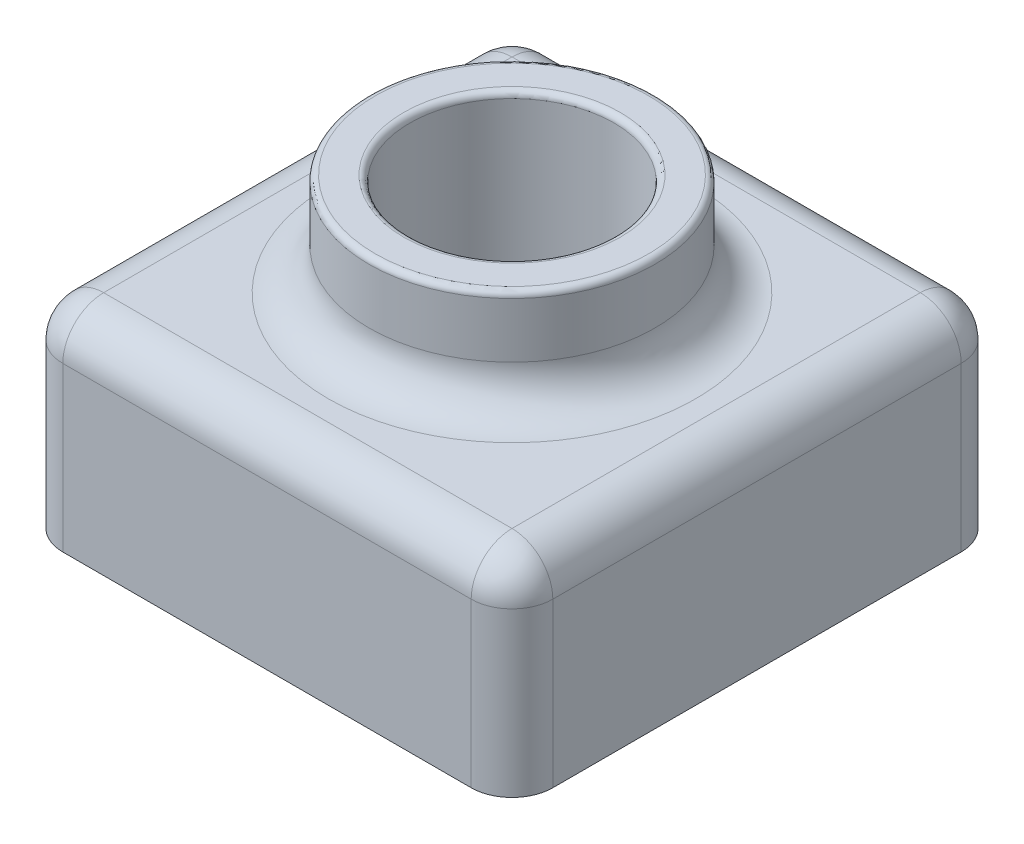
ISO-10303-21;
HEADER;
FILE_DESCRIPTION(('STEP AP214'),'2;1');
FILE_NAME('part.step','',(''),(''),'','','');
FILE_SCHEMA(('AUTOMOTIVE_DESIGN { 1 0 10303 214 1 1 1 1 }'));
ENDSEC;
DATA;
#1=APPLICATION_CONTEXT('core data for automotive mechanical design processes');
#2=APPLICATION_PROTOCOL_DEFINITION('international standard','automotive_design',2000,#1);
#3=PRODUCT_CONTEXT('',#1,'mechanical');
#4=PRODUCT('Part','Part','',(#3));
#5=PRODUCT_RELATED_PRODUCT_CATEGORY('part','',(#4));
#6=PRODUCT_DEFINITION_FORMATION('','',#4);
#7=PRODUCT_DEFINITION_CONTEXT('part definition',#1,'design');
#8=PRODUCT_DEFINITION('design','',#6,#7);
#9=PRODUCT_DEFINITION_SHAPE('','',#8);
#10=(LENGTH_UNIT() NAMED_UNIT(*) SI_UNIT(.MILLI.,.METRE.));
#11=(NAMED_UNIT(*) PLANE_ANGLE_UNIT() SI_UNIT($,.RADIAN.));
#12=(NAMED_UNIT(*) SI_UNIT($,.STERADIAN.) SOLID_ANGLE_UNIT());
#13=UNCERTAINTY_MEASURE_WITH_UNIT(LENGTH_MEASURE(1.E-05),#10,'distance_accuracy_value','');
#14=(GEOMETRIC_REPRESENTATION_CONTEXT(3) GLOBAL_UNCERTAINTY_ASSIGNED_CONTEXT((#13)) GLOBAL_UNIT_ASSIGNED_CONTEXT((#10,
#11,#12)) REPRESENTATION_CONTEXT('',''));
#15=CARTESIAN_POINT('',(0.,0.,0.));
#16=DIRECTION('',(0.,0.,1.));
#17=DIRECTION('',(1.,0.,0.));
#18=AXIS2_PLACEMENT_3D('',#15,#16,#17);
#19=CARTESIAN_POINT('',(0.,0.,0.));
#20=DIRECTION('',(0.,1.,0.));
#21=DIRECTION('',(0.,0.,1.));
#22=AXIS2_PLACEMENT_3D('',#19,#20,#21);
#23=PLANE('',#22);
#24=CARTESIAN_POINT('',(60.,0.,-60.));
#25=DIRECTION('',(0.,1.,0.));
#26=DIRECTION('',(0.,0.,1.));
#27=AXIS2_PLACEMENT_3D('',#24,#25,#26);
#28=CIRCLE('',#27,27.);
#29=CARTESIAN_POINT('',(60.,0.,-33.));
#30=VERTEX_POINT('',#29);
#31=EDGE_CURVE('E261',#30,#30,#28,.T.);
#32=ORIENTED_EDGE('',*,*,#31,.F.);
#33=EDGE_LOOP('',(#32));
#34=FACE_BOUND('',#33,.T.);
#35=CARTESIAN_POINT('',(60.,0.,-60.));
#36=DIRECTION('',(0.,1.,0.));
#37=DIRECTION('',(0.,0.,1.));
#38=AXIS2_PLACEMENT_3D('',#35,#36,#37);
#39=CIRCLE('',#38,25.);
#40=CARTESIAN_POINT('',(60.,0.,-35.));
#41=VERTEX_POINT('',#40);
#42=EDGE_CURVE('E286',#41,#41,#39,.T.);
#43=ORIENTED_EDGE('',*,*,#42,.T.);
#44=EDGE_LOOP('',(#43));
#45=FACE_BOUND('',#44,.T.);
#46=ADVANCED_FACE('F39',(#34,#45),#23,.F.);
#47=CARTESIAN_POINT('',(0.,50.,-120.));
#48=DIRECTION('',(0.,0.,-1.));
#49=DIRECTION('',(-1.,0.,0.));
#50=AXIS2_PLACEMENT_3D('',#47,#48,#49);
#51=PLANE('',#50);
#52=DIRECTION('',(1.,0.,0.));
#53=VECTOR('',#52,1.);
#54=CARTESIAN_POINT('',(0.,40.,-120.));
#55=LINE('',#54,#53);
#56=CARTESIAN_POINT('',(9.99999999999996,40.,-120.));
#57=VERTEX_POINT('',#56);
#58=CARTESIAN_POINT('',(110.,40.,-120.));
#59=VERTEX_POINT('',#58);
#60=EDGE_CURVE('E63',#57,#59,#55,.T.);
#61=ORIENTED_EDGE('',*,*,#60,.T.);
#62=DIRECTION('',(0.,-1.,0.));
#63=VECTOR('',#62,1.);
#64=CARTESIAN_POINT('',(110.,0.,-120.));
#65=LINE('',#64,#63);
#66=CARTESIAN_POINT('',(110.,0.,-120.));
#67=VERTEX_POINT('',#66);
#68=EDGE_CURVE('E357',#59,#67,#65,.T.);
#69=ORIENTED_EDGE('',*,*,#68,.T.);
#70=DIRECTION('',(1.,0.,0.));
#71=VECTOR('',#70,1.);
#72=CARTESIAN_POINT('',(0.,0.,-120.));
#73=LINE('',#72,#71);
#74=CARTESIAN_POINT('',(9.99999999999996,0.,-120.));
#75=VERTEX_POINT('',#74);
#76=EDGE_CURVE('E290',#75,#67,#73,.T.);
#77=ORIENTED_EDGE('',*,*,#76,.F.);
#78=DIRECTION('',(0.,-1.,0.));
#79=VECTOR('',#78,1.);
#80=CARTESIAN_POINT('',(9.99999999999996,50.,-120.));
#81=LINE('',#80,#79);
#82=EDGE_CURVE('E352',#75,#57,#81,.F.);
#83=ORIENTED_EDGE('',*,*,#82,.T.);
#84=EDGE_LOOP('',(#61,#69,#77,#83));
#85=FACE_BOUND('',#84,.T.);
#86=ADVANCED_FACE('F458',(#85),#51,.T.);
#87=CARTESIAN_POINT('',(0.,50.,0.));
#88=DIRECTION('',(-1.,0.,0.));
#89=DIRECTION('',(0.,0.,1.));
#90=AXIS2_PLACEMENT_3D('',#87,#88,#89);
#91=PLANE('',#90);
#92=DIRECTION('',(0.,0.,-1.));
#93=VECTOR('',#92,1.);
#94=CARTESIAN_POINT('',(0.,40.,0.));
#95=LINE('',#94,#93);
#96=CARTESIAN_POINT('',(0.,40.,-10.));
#97=VERTEX_POINT('',#96);
#98=CARTESIAN_POINT('',(0.,40.,-110.));
#99=VERTEX_POINT('',#98);
#100=EDGE_CURVE('E346',#97,#99,#95,.T.);
#101=ORIENTED_EDGE('',*,*,#100,.T.);
#102=DIRECTION('',(0.,-1.,0.));
#103=VECTOR('',#102,1.);
#104=CARTESIAN_POINT('',(0.,50.,-110.));
#105=LINE('',#104,#103);
#106=CARTESIAN_POINT('',(0.,0.,-110.));
#107=VERTEX_POINT('',#106);
#108=EDGE_CURVE('E349',#99,#107,#105,.T.);
#109=ORIENTED_EDGE('',*,*,#108,.T.);
#110=DIRECTION('',(0.,0.,-1.));
#111=VECTOR('',#110,1.);
#112=CARTESIAN_POINT('',(0.,0.,0.));
#113=LINE('',#112,#111);
#114=CARTESIAN_POINT('',(0.,0.,-10.));
#115=VERTEX_POINT('',#114);
#116=EDGE_CURVE('E303',#115,#107,#113,.T.);
#117=ORIENTED_EDGE('',*,*,#116,.F.);
#118=DIRECTION('',(0.,-1.,0.));
#119=VECTOR('',#118,1.);
#120=CARTESIAN_POINT('',(0.,50.,-10.));
#121=LINE('',#120,#119);
#122=EDGE_CURVE('E343',#115,#97,#121,.F.);
#123=ORIENTED_EDGE('',*,*,#122,.T.);
#124=EDGE_LOOP('',(#101,#109,#117,#123));
#125=FACE_BOUND('',#124,.T.);
#126=ADVANCED_FACE('F465',(#125),#91,.T.);
#127=CARTESIAN_POINT('',(0.,50.,0.));
#128=DIRECTION('',(0.,0.,-1.));
#129=DIRECTION('',(-1.,0.,0.));
#130=AXIS2_PLACEMENT_3D('',#127,#128,#129);
#131=PLANE('',#130);
#132=DIRECTION('',(1.,0.,0.));
#133=VECTOR('',#132,1.);
#134=CARTESIAN_POINT('',(0.,40.,0.));
#135=LINE('',#134,#133);
#136=CARTESIAN_POINT('',(110.,40.,0.));
#137=VERTEX_POINT('',#136);
#138=CARTESIAN_POINT('',(10.,40.,0.));
#139=VERTEX_POINT('',#138);
#140=EDGE_CURVE('E337',#137,#139,#135,.F.);
#141=ORIENTED_EDGE('',*,*,#140,.T.);
#142=DIRECTION('',(0.,-1.,0.));
#143=VECTOR('',#142,1.);
#144=CARTESIAN_POINT('',(10.,0.,0.));
#145=LINE('',#144,#143);
#146=CARTESIAN_POINT('',(10.,0.,0.));
#147=VERTEX_POINT('',#146);
#148=EDGE_CURVE('E340',#139,#147,#145,.T.);
#149=ORIENTED_EDGE('',*,*,#148,.T.);
#150=DIRECTION('',(1.,0.,0.));
#151=VECTOR('',#150,1.);
#152=CARTESIAN_POINT('',(0.,0.,0.));
#153=LINE('',#152,#151);
#154=CARTESIAN_POINT('',(110.,0.,0.));
#155=VERTEX_POINT('',#154);
#156=EDGE_CURVE('E299',#147,#155,#153,.T.);
#157=ORIENTED_EDGE('',*,*,#156,.T.);
#158=DIRECTION('',(0.,-1.,0.));
#159=VECTOR('',#158,1.);
#160=CARTESIAN_POINT('',(110.,50.,0.));
#161=LINE('',#160,#159);
#162=EDGE_CURVE('E334',#155,#137,#161,.F.);
#163=ORIENTED_EDGE('',*,*,#162,.T.);
#164=EDGE_LOOP('',(#141,#149,#157,#163));
#165=FACE_BOUND('',#164,.T.);
#166=ADVANCED_FACE('F503',(#165),#131,.F.);
#167=CARTESIAN_POINT('',(120.,50.,0.));
#168=DIRECTION('',(-1.,0.,0.));
#169=DIRECTION('',(0.,0.,1.));
#170=AXIS2_PLACEMENT_3D('',#167,#168,#169);
#171=PLANE('',#170);
#172=DIRECTION('',(0.,0.,-1.));
#173=VECTOR('',#172,1.);
#174=CARTESIAN_POINT('',(120.,0.,0.));
#175=LINE('',#174,#173);
#176=CARTESIAN_POINT('',(120.,0.,-10.));
#177=VERTEX_POINT('',#176);
#178=CARTESIAN_POINT('',(120.,0.,-110.));
#179=VERTEX_POINT('',#178);
#180=EDGE_CURVE('E295',#177,#179,#175,.T.);
#181=ORIENTED_EDGE('',*,*,#180,.T.);
#182=DIRECTION('',(0.,-1.,0.));
#183=VECTOR('',#182,1.);
#184=CARTESIAN_POINT('',(120.,50.,-110.));
#185=LINE('',#184,#183);
#186=CARTESIAN_POINT('',(120.,40.,-110.));
#187=VERTEX_POINT('',#186);
#188=EDGE_CURVE('E331',#179,#187,#185,.F.);
#189=ORIENTED_EDGE('',*,*,#188,.T.);
#190=DIRECTION('',(0.,0.,-1.));
#191=VECTOR('',#190,1.);
#192=CARTESIAN_POINT('',(120.,40.,0.));
#193=LINE('',#192,#191);
#194=CARTESIAN_POINT('',(120.,40.,-10.));
#195=VERTEX_POINT('',#194);
#196=EDGE_CURVE('E327',#187,#195,#193,.F.);
#197=ORIENTED_EDGE('',*,*,#196,.T.);
#198=DIRECTION('',(0.,-1.,0.));
#199=VECTOR('',#198,1.);
#200=CARTESIAN_POINT('',(120.,50.,-10.));
#201=LINE('',#200,#199);
#202=EDGE_CURVE('E324',#195,#177,#201,.T.);
#203=ORIENTED_EDGE('',*,*,#202,.T.);
#204=EDGE_LOOP('',(#181,#189,#197,#203));
#205=FACE_BOUND('',#204,.T.);
#206=ADVANCED_FACE('F478',(#205),#171,.F.);
#207=CARTESIAN_POINT('',(0.,50.,0.));
#208=DIRECTION('',(0.,1.,0.));
#209=DIRECTION('',(0.,0.,1.));
#210=AXIS2_PLACEMENT_3D('',#207,#208,#209);
#211=PLANE('',#210);
#212=DIRECTION('',(1.,0.,0.));
#213=VECTOR('',#212,1.);
#214=CARTESIAN_POINT('',(120.,50.,-10.));
#215=LINE('',#214,#213);
#216=CARTESIAN_POINT('',(10.,50.,-10.));
#217=VERTEX_POINT('',#216);
#218=CARTESIAN_POINT('',(110.,50.,-10.));
#219=VERTEX_POINT('',#218);
#220=EDGE_CURVE('E317',#217,#219,#215,.T.);
#221=ORIENTED_EDGE('',*,*,#220,.T.);
#222=DIRECTION('',(0.,0.,-1.));
#223=VECTOR('',#222,1.);
#224=CARTESIAN_POINT('',(110.,50.,-120.));
#225=LINE('',#224,#223);
#226=CARTESIAN_POINT('',(110.,50.,-110.));
#227=VERTEX_POINT('',#226);
#228=EDGE_CURVE('E320',#219,#227,#225,.T.);
#229=ORIENTED_EDGE('',*,*,#228,.T.);
#230=DIRECTION('',(1.,0.,0.));
#231=VECTOR('',#230,1.);
#232=CARTESIAN_POINT('',(0.,50.,-110.));
#233=LINE('',#232,#231);
#234=CARTESIAN_POINT('',(9.99999999999996,50.,-110.));
#235=VERTEX_POINT('',#234);
#236=EDGE_CURVE('E311',#227,#235,#233,.F.);
#237=ORIENTED_EDGE('',*,*,#236,.T.);
#238=DIRECTION('',(0.,0.,-1.));
#239=VECTOR('',#238,1.);
#240=CARTESIAN_POINT('',(10.,50.,0.));
#241=LINE('',#240,#239);
#242=EDGE_CURVE('E314',#235,#217,#241,.F.);
#243=ORIENTED_EDGE('',*,*,#242,.T.);
#244=EDGE_LOOP('',(#221,#229,#237,#243));
#245=FACE_BOUND('',#244,.T.);
#246=CARTESIAN_POINT('',(60.,50.,-60.));
#247=DIRECTION('',(0.,1.,0.));
#248=DIRECTION('',(0.,0.,1.));
#249=AXIS2_PLACEMENT_3D('',#246,#247,#248);
#250=CIRCLE('',#249,45.);
#251=CARTESIAN_POINT('',(60.,50.,-15.));
#252=VERTEX_POINT('',#251);
#253=EDGE_CURVE('E307',#252,#252,#250,.F.);
#254=ORIENTED_EDGE('',*,*,#253,.T.);
#255=EDGE_LOOP('',(#254));
#256=FACE_BOUND('',#255,.T.);
#257=ADVANCED_FACE('F471',(#245,#256),#211,.T.);
#258=DIRECTION('',(1.,0.,0.));
#259=VECTOR('',#258,1.);
#260=CARTESIAN_POINT('',(0.,0.,-118.));
#261=LINE('',#260,#259);
#262=CARTESIAN_POINT('',(9.99999999999996,0.,-118.));
#263=VERTEX_POINT('',#262);
#264=CARTESIAN_POINT('',(110.,0.,-118.));
#265=VERTEX_POINT('',#264);
#266=EDGE_CURVE('E197',#263,#265,#261,.T.);
#267=ORIENTED_EDGE('',*,*,#266,.F.);
#268=CARTESIAN_POINT('',(9.99999999999996,0.,-110.));
#269=DIRECTION('',(0.,1.,0.));
#270=DIRECTION('',(0.,0.,1.));
#271=AXIS2_PLACEMENT_3D('',#268,#269,#270);
#272=CIRCLE('',#271,8.);
#273=CARTESIAN_POINT('',(1.99999999999996,0.,-110.));
#274=VERTEX_POINT('',#273);
#275=EDGE_CURVE('E264',#274,#263,#272,.F.);
#276=ORIENTED_EDGE('',*,*,#275,.F.);
#277=DIRECTION('',(0.,0.,-1.));
#278=VECTOR('',#277,1.);
#279=CARTESIAN_POINT('',(2.,0.,0.));
#280=LINE('',#279,#278);
#281=CARTESIAN_POINT('',(2.,0.,-10.));
#282=VERTEX_POINT('',#281);
#283=EDGE_CURVE('E55',#282,#274,#280,.T.);
#284=ORIENTED_EDGE('',*,*,#283,.F.);
#285=CARTESIAN_POINT('',(10.,0.,-10.));
#286=DIRECTION('',(0.,1.,0.));
#287=DIRECTION('',(0.,0.,1.));
#288=AXIS2_PLACEMENT_3D('',#285,#286,#287);
#289=CIRCLE('',#288,8.);
#290=CARTESIAN_POINT('',(10.,0.,-2.));
#291=VERTEX_POINT('',#290);
#292=EDGE_CURVE('E271',#291,#282,#289,.F.);
#293=ORIENTED_EDGE('',*,*,#292,.F.);
#294=DIRECTION('',(1.,0.,0.));
#295=VECTOR('',#294,1.);
#296=CARTESIAN_POINT('',(0.,0.,-2.));
#297=LINE('',#296,#295);
#298=CARTESIAN_POINT('',(110.,0.,-2.));
#299=VERTEX_POINT('',#298);
#300=EDGE_CURVE('E268',#291,#299,#297,.T.);
#301=ORIENTED_EDGE('',*,*,#300,.T.);
#302=CARTESIAN_POINT('',(110.,0.,-10.));
#303=DIRECTION('',(0.,1.,0.));
#304=DIRECTION('',(0.,0.,1.));
#305=AXIS2_PLACEMENT_3D('',#302,#303,#304);
#306=CIRCLE('',#305,8.);
#307=CARTESIAN_POINT('',(118.,0.,-10.));
#308=VERTEX_POINT('',#307);
#309=EDGE_CURVE('E247',#308,#299,#306,.F.);
#310=ORIENTED_EDGE('',*,*,#309,.F.);
#311=DIRECTION('',(0.,0.,-1.));
#312=VECTOR('',#311,1.);
#313=CARTESIAN_POINT('',(118.,0.,0.));
#314=LINE('',#313,#312);
#315=CARTESIAN_POINT('',(118.,0.,-110.));
#316=VERTEX_POINT('',#315);
#317=EDGE_CURVE('E260',#308,#316,#314,.T.);
#318=ORIENTED_EDGE('',*,*,#317,.T.);
#319=CARTESIAN_POINT('',(110.,0.,-110.));
#320=DIRECTION('',(0.,1.,0.));
#321=DIRECTION('',(0.,0.,1.));
#322=AXIS2_PLACEMENT_3D('',#319,#320,#321);
#323=CIRCLE('',#322,8.);
#324=EDGE_CURVE('E253',#265,#316,#323,.F.);
#325=ORIENTED_EDGE('',*,*,#324,.F.);
#326=EDGE_LOOP('',(#267,#276,#284,#293,#301,#310,#318,#325));
#327=FACE_BOUND('',#326,.T.);
#328=ORIENTED_EDGE('',*,*,#76,.T.);
#329=CARTESIAN_POINT('',(110.,0.,-110.));
#330=DIRECTION('',(0.,1.,0.));
#331=DIRECTION('',(0.,0.,1.));
#332=AXIS2_PLACEMENT_3D('',#329,#330,#331);
#333=CIRCLE('',#332,10.);
#334=EDGE_CURVE('E373',#67,#179,#333,.F.);
#335=ORIENTED_EDGE('',*,*,#334,.T.);
#336=ORIENTED_EDGE('',*,*,#180,.F.);
#337=CARTESIAN_POINT('',(110.,0.,-10.));
#338=DIRECTION('',(0.,1.,0.));
#339=DIRECTION('',(0.,0.,1.));
#340=AXIS2_PLACEMENT_3D('',#337,#338,#339);
#341=CIRCLE('',#340,10.);
#342=EDGE_CURVE('E364',#177,#155,#341,.F.);
#343=ORIENTED_EDGE('',*,*,#342,.T.);
#344=ORIENTED_EDGE('',*,*,#156,.F.);
#345=CARTESIAN_POINT('',(10.,0.,-10.));
#346=DIRECTION('',(0.,1.,0.));
#347=DIRECTION('',(0.,0.,1.));
#348=AXIS2_PLACEMENT_3D('',#345,#346,#347);
#349=CIRCLE('',#348,10.);
#350=EDGE_CURVE('E367',#147,#115,#349,.F.);
#351=ORIENTED_EDGE('',*,*,#350,.T.);
#352=ORIENTED_EDGE('',*,*,#116,.T.);
#353=CARTESIAN_POINT('',(9.99999999999996,0.,-110.));
#354=DIRECTION('',(0.,1.,0.));
#355=DIRECTION('',(0.,0.,1.));
#356=AXIS2_PLACEMENT_3D('',#353,#354,#355);
#357=CIRCLE('',#356,10.);
#358=EDGE_CURVE('E370',#107,#75,#357,.F.);
#359=ORIENTED_EDGE('',*,*,#358,.T.);
#360=EDGE_LOOP('',(#328,#335,#336,#343,#344,#351,#352,#359));
#361=FACE_BOUND('',#360,.T.);
#362=ADVANCED_FACE('F461',(#327,#361),#23,.F.);
#363=CARTESIAN_POINT('',(60.,75.,-60.));
#364=DIRECTION('',(0.,-1.,0.));
#365=DIRECTION('',(0.,0.,-1.));
#366=AXIS2_PLACEMENT_3D('',#363,#364,#365);
#367=CYLINDRICAL_SURFACE('',#366,35.);
#368=CARTESIAN_POINT('',(60.,73.5,-60.));
#369=DIRECTION('',(0.,1.,0.));
#370=DIRECTION('',(0.,0.,1.));
#371=AXIS2_PLACEMENT_3D('',#368,#369,#370);
#372=CIRCLE('',#371,35.);
#373=CARTESIAN_POINT('',(60.,73.5,-25.));
#374=VERTEX_POINT('',#373);
#375=EDGE_CURVE('E48',#374,#374,#372,.F.);
#376=ORIENTED_EDGE('',*,*,#375,.T.);
#377=EDGE_LOOP('',(#376));
#378=FACE_BOUND('',#377,.T.);
#379=CARTESIAN_POINT('',(60.,60.,-60.));
#380=DIRECTION('',(0.,1.,0.));
#381=DIRECTION('',(0.,0.,1.));
#382=AXIS2_PLACEMENT_3D('',#379,#380,#381);
#383=CIRCLE('',#382,35.);
#384=CARTESIAN_POINT('',(60.,60.,-25.));
#385=VERTEX_POINT('',#384);
#386=EDGE_CURVE('E360',#385,#385,#383,.T.);
#387=ORIENTED_EDGE('',*,*,#386,.T.);
#388=EDGE_LOOP('',(#387));
#389=FACE_BOUND('',#388,.T.);
#390=ADVANCED_FACE('F431',(#378,#389),#367,.T.);
#391=CARTESIAN_POINT('',(60.,75.,-60.));
#392=DIRECTION('',(0.,1.,0.));
#393=DIRECTION('',(0.,0.,1.));
#394=AXIS2_PLACEMENT_3D('',#391,#392,#393);
#395=PLANE('',#394);
#396=CARTESIAN_POINT('',(60.,75.,-60.));
#397=DIRECTION('',(0.,1.,0.));
#398=DIRECTION('',(0.,0.,1.));
#399=AXIS2_PLACEMENT_3D('',#396,#397,#398);
#400=CIRCLE('',#399,33.5);
#401=CARTESIAN_POINT('',(60.,75.,-26.5));
#402=VERTEX_POINT('',#401);
#403=EDGE_CURVE('E424',#402,#402,#400,.T.);
#404=ORIENTED_EDGE('',*,*,#403,.T.);
#405=EDGE_LOOP('',(#404));
#406=FACE_BOUND('',#405,.T.);
#407=CARTESIAN_POINT('',(60.,75.,-60.));
#408=DIRECTION('',(0.,1.,0.));
#409=DIRECTION('',(0.,0.,1.));
#410=AXIS2_PLACEMENT_3D('',#407,#408,#409);
#411=CIRCLE('',#410,26.5);
#412=CARTESIAN_POINT('',(60.,75.,-33.5));
#413=VERTEX_POINT('',#412);
#414=EDGE_CURVE('E376',#413,#413,#411,.F.);
#415=ORIENTED_EDGE('',*,*,#414,.T.);
#416=EDGE_LOOP('',(#415));
#417=FACE_BOUND('',#416,.T.);
#418=ADVANCED_FACE('F440',(#406,#417),#395,.T.);
#419=CARTESIAN_POINT('',(60.,0.,-60.));
#420=DIRECTION('',(0.,1.,0.));
#421=DIRECTION('',(0.,0.,1.));
#422=AXIS2_PLACEMENT_3D('',#419,#420,#421);
#423=CYLINDRICAL_SURFACE('',#422,25.);
#424=CARTESIAN_POINT('',(60.,73.5,-60.));
#425=DIRECTION('',(0.,1.,0.));
#426=DIRECTION('',(0.,0.,1.));
#427=AXIS2_PLACEMENT_3D('',#424,#425,#426);
#428=CIRCLE('',#427,25.);
#429=CARTESIAN_POINT('',(60.,73.5,-35.));
#430=VERTEX_POINT('',#429);
#431=EDGE_CURVE('E11',#430,#430,#428,.T.);
#432=ORIENTED_EDGE('',*,*,#431,.T.);
#433=EDGE_LOOP('',(#432));
#434=FACE_BOUND('',#433,.T.);
#435=ORIENTED_EDGE('',*,*,#42,.F.);
#436=EDGE_LOOP('',(#435));
#437=FACE_BOUND('',#436,.T.);
#438=ADVANCED_FACE('F443',(#434,#437),#423,.F.);
#439=CARTESIAN_POINT('',(10.,50.,-10.));
#440=DIRECTION('',(0.,1.,0.));
#441=DIRECTION('',(0.,0.,1.));
#442=AXIS2_PLACEMENT_3D('',#439,#440,#441);
#443=CYLINDRICAL_SURFACE('',#442,10.);
#444=ORIENTED_EDGE('',*,*,#350,.F.);
#445=ORIENTED_EDGE('',*,*,#148,.F.);
#446=CARTESIAN_POINT('',(10.,40.,-10.));
#447=DIRECTION('',(0.,1.,0.));
#448=DIRECTION('',(0.,0.,1.));
#449=AXIS2_PLACEMENT_3D('',#446,#447,#448);
#450=CIRCLE('',#449,10.);
#451=EDGE_CURVE('E291',#97,#139,#450,.T.);
#452=ORIENTED_EDGE('',*,*,#451,.F.);
#453=ORIENTED_EDGE('',*,*,#122,.F.);
#454=EDGE_LOOP('',(#444,#445,#452,#453));
#455=FACE_BOUND('',#454,.T.);
#456=ADVANCED_FACE('F453',(#455),#443,.T.);
#457=CARTESIAN_POINT('',(10.,40.,0.));
#458=DIRECTION('',(0.,0.,-1.));
#459=DIRECTION('',(-1.,0.,0.));
#460=AXIS2_PLACEMENT_3D('',#457,#458,#459);
#461=CYLINDRICAL_SURFACE('',#460,10.);
#462=CARTESIAN_POINT('',(9.99999999999996,40.,-110.));
#463=DIRECTION('',(0.,0.,-1.));
#464=DIRECTION('',(-1.,0.,0.));
#465=AXIS2_PLACEMENT_3D('',#462,#463,#464);
#466=CIRCLE('',#465,10.);
#467=EDGE_CURVE('E410',#99,#235,#466,.T.);
#468=ORIENTED_EDGE('',*,*,#467,.F.);
#469=ORIENTED_EDGE('',*,*,#100,.F.);
#470=CARTESIAN_POINT('',(10.,40.,-10.));
#471=DIRECTION('',(0.,0.,1.));
#472=DIRECTION('',(1.,0.,0.));
#473=AXIS2_PLACEMENT_3D('',#470,#471,#472);
#474=CIRCLE('',#473,10.);
#475=EDGE_CURVE('E414',#217,#97,#474,.T.);
#476=ORIENTED_EDGE('',*,*,#475,.F.);
#477=ORIENTED_EDGE('',*,*,#242,.F.);
#478=EDGE_LOOP('',(#468,#469,#476,#477));
#479=FACE_BOUND('',#478,.T.);
#480=ADVANCED_FACE('F529',(#479),#461,.T.);
#481=CARTESIAN_POINT('',(9.99999999999996,50.,-110.));
#482=DIRECTION('',(0.,-1.,0.));
#483=DIRECTION('',(0.,0.,-1.));
#484=AXIS2_PLACEMENT_3D('',#481,#482,#483);
#485=CYLINDRICAL_SURFACE('',#484,10.);
#486=ORIENTED_EDGE('',*,*,#358,.F.);
#487=ORIENTED_EDGE('',*,*,#108,.F.);
#488=CARTESIAN_POINT('',(9.99999999999996,40.,-110.));
#489=DIRECTION('',(0.,1.,0.));
#490=DIRECTION('',(0.,0.,1.));
#491=AXIS2_PLACEMENT_3D('',#488,#489,#490);
#492=CIRCLE('',#491,10.);
#493=EDGE_CURVE('E406',#57,#99,#492,.T.);
#494=ORIENTED_EDGE('',*,*,#493,.F.);
#495=ORIENTED_EDGE('',*,*,#82,.F.);
#496=EDGE_LOOP('',(#486,#487,#494,#495));
#497=FACE_BOUND('',#496,.T.);
#498=ADVANCED_FACE('F525',(#497),#485,.T.);
#499=CARTESIAN_POINT('',(10.,40.,-10.));
#500=DIRECTION('',(0.,0.,1.));
#501=DIRECTION('',(1.,0.,0.));
#502=AXIS2_PLACEMENT_3D('',#499,#500,#501);
#503=SPHERICAL_SURFACE('',#502,10.);
#504=ORIENTED_EDGE('',*,*,#475,.T.);
#505=ORIENTED_EDGE('',*,*,#451,.T.);
#506=CARTESIAN_POINT('',(10.,40.,-10.));
#507=DIRECTION('',(-1.,0.,0.));
#508=DIRECTION('',(0.,0.,1.));
#509=AXIS2_PLACEMENT_3D('',#506,#507,#508);
#510=CIRCLE('',#509,10.);
#511=EDGE_CURVE('E402',#217,#139,#510,.F.);
#512=ORIENTED_EDGE('',*,*,#511,.F.);
#513=EDGE_LOOP('',(#504,#505,#512));
#514=FACE_BOUND('',#513,.T.);
#515=ADVANCED_FACE('F512',(#514),#503,.T.);
#516=CARTESIAN_POINT('',(9.99999999999996,40.,-110.));
#517=DIRECTION('',(0.,0.,1.));
#518=DIRECTION('',(1.,0.,0.));
#519=AXIS2_PLACEMENT_3D('',#516,#517,#518);
#520=SPHERICAL_SURFACE('',#519,10.);
#521=ORIENTED_EDGE('',*,*,#493,.T.);
#522=ORIENTED_EDGE('',*,*,#467,.T.);
#523=CARTESIAN_POINT('',(9.99999999999996,40.,-110.));
#524=DIRECTION('',(-1.,0.,0.));
#525=DIRECTION('',(0.,0.,1.));
#526=AXIS2_PLACEMENT_3D('',#523,#524,#525);
#527=CIRCLE('',#526,10.);
#528=EDGE_CURVE('E398',#57,#235,#527,.F.);
#529=ORIENTED_EDGE('',*,*,#528,.F.);
#530=EDGE_LOOP('',(#521,#522,#529));
#531=FACE_BOUND('',#530,.T.);
#532=ADVANCED_FACE('F531',(#531),#520,.T.);
#533=CARTESIAN_POINT('',(110.,50.,-10.));
#534=DIRECTION('',(0.,-1.,0.));
#535=DIRECTION('',(0.,0.,-1.));
#536=AXIS2_PLACEMENT_3D('',#533,#534,#535);
#537=CYLINDRICAL_SURFACE('',#536,10.);
#538=ORIENTED_EDGE('',*,*,#342,.F.);
#539=ORIENTED_EDGE('',*,*,#202,.F.);
#540=CARTESIAN_POINT('',(110.,40.,-10.));
#541=DIRECTION('',(0.,1.,0.));
#542=DIRECTION('',(0.,0.,1.));
#543=AXIS2_PLACEMENT_3D('',#540,#541,#542);
#544=CIRCLE('',#543,10.);
#545=EDGE_CURVE('E394',#137,#195,#544,.T.);
#546=ORIENTED_EDGE('',*,*,#545,.F.);
#547=ORIENTED_EDGE('',*,*,#162,.F.);
#548=EDGE_LOOP('',(#538,#539,#546,#547));
#549=FACE_BOUND('',#548,.T.);
#550=ADVANCED_FACE('F499',(#549),#537,.T.);
#551=CARTESIAN_POINT('',(0.,40.,-10.));
#552=DIRECTION('',(-1.,0.,0.));
#553=DIRECTION('',(0.,0.,1.));
#554=AXIS2_PLACEMENT_3D('',#551,#552,#553);
#555=CYLINDRICAL_SURFACE('',#554,10.);
#556=ORIENTED_EDGE('',*,*,#511,.T.);
#557=ORIENTED_EDGE('',*,*,#140,.F.);
#558=CARTESIAN_POINT('',(110.,40.,-10.));
#559=DIRECTION('',(1.,0.,0.));
#560=DIRECTION('',(0.,0.,-1.));
#561=AXIS2_PLACEMENT_3D('',#558,#559,#560);
#562=CIRCLE('',#561,10.);
#563=EDGE_CURVE('E390',#219,#137,#562,.T.);
#564=ORIENTED_EDGE('',*,*,#563,.F.);
#565=ORIENTED_EDGE('',*,*,#220,.F.);
#566=EDGE_LOOP('',(#556,#557,#564,#565));
#567=FACE_BOUND('',#566,.T.);
#568=ADVANCED_FACE('F507',(#567),#555,.T.);
#569=CARTESIAN_POINT('',(0.,40.,-110.));
#570=DIRECTION('',(1.,0.,0.));
#571=DIRECTION('',(0.,0.,-1.));
#572=AXIS2_PLACEMENT_3D('',#569,#570,#571);
#573=CYLINDRICAL_SURFACE('',#572,10.);
#574=ORIENTED_EDGE('',*,*,#528,.T.);
#575=ORIENTED_EDGE('',*,*,#236,.F.);
#576=CARTESIAN_POINT('',(110.,40.,-110.));
#577=DIRECTION('',(1.,0.,0.));
#578=DIRECTION('',(0.,0.,-1.));
#579=AXIS2_PLACEMENT_3D('',#576,#577,#578);
#580=CIRCLE('',#579,10.);
#581=EDGE_CURVE('E386',#59,#227,#580,.T.);
#582=ORIENTED_EDGE('',*,*,#581,.F.);
#583=ORIENTED_EDGE('',*,*,#60,.F.);
#584=EDGE_LOOP('',(#574,#575,#582,#583));
#585=FACE_BOUND('',#584,.T.);
#586=ADVANCED_FACE('F534',(#585),#573,.T.);
#587=CARTESIAN_POINT('',(110.,50.,-110.));
#588=DIRECTION('',(0.,1.,0.));
#589=DIRECTION('',(0.,0.,1.));
#590=AXIS2_PLACEMENT_3D('',#587,#588,#589);
#591=CYLINDRICAL_SURFACE('',#590,10.);
#592=ORIENTED_EDGE('',*,*,#334,.F.);
#593=ORIENTED_EDGE('',*,*,#68,.F.);
#594=CARTESIAN_POINT('',(110.,40.,-110.));
#595=DIRECTION('',(0.,1.,0.));
#596=DIRECTION('',(0.,0.,1.));
#597=AXIS2_PLACEMENT_3D('',#594,#595,#596);
#598=CIRCLE('',#597,10.);
#599=EDGE_CURVE('E382',#187,#59,#598,.T.);
#600=ORIENTED_EDGE('',*,*,#599,.F.);
#601=ORIENTED_EDGE('',*,*,#188,.F.);
#602=EDGE_LOOP('',(#592,#593,#600,#601));
#603=FACE_BOUND('',#602,.T.);
#604=ADVANCED_FACE('F489',(#603),#591,.T.);
#605=CARTESIAN_POINT('',(110.,40.,-10.));
#606=DIRECTION('',(0.,0.,1.));
#607=DIRECTION('',(1.,0.,0.));
#608=AXIS2_PLACEMENT_3D('',#605,#606,#607);
#609=SPHERICAL_SURFACE('',#608,10.);
#610=ORIENTED_EDGE('',*,*,#563,.T.);
#611=ORIENTED_EDGE('',*,*,#545,.T.);
#612=CARTESIAN_POINT('',(110.,40.,-10.));
#613=DIRECTION('',(0.,0.,1.));
#614=DIRECTION('',(1.,0.,0.));
#615=AXIS2_PLACEMENT_3D('',#612,#613,#614);
#616=CIRCLE('',#615,10.);
#617=EDGE_CURVE('E379',#219,#195,#616,.F.);
#618=ORIENTED_EDGE('',*,*,#617,.F.);
#619=EDGE_LOOP('',(#610,#611,#618));
#620=FACE_BOUND('',#619,.T.);
#621=ADVANCED_FACE('F542',(#620),#609,.T.);
#622=CARTESIAN_POINT('',(110.,40.,-110.));
#623=DIRECTION('',(0.,0.,1.));
#624=DIRECTION('',(1.,0.,0.));
#625=AXIS2_PLACEMENT_3D('',#622,#623,#624);
#626=SPHERICAL_SURFACE('',#625,10.);
#627=ORIENTED_EDGE('',*,*,#599,.T.);
#628=ORIENTED_EDGE('',*,*,#581,.T.);
#629=CARTESIAN_POINT('',(110.,40.,-110.));
#630=DIRECTION('',(0.,0.,-1.));
#631=DIRECTION('',(-1.,0.,0.));
#632=AXIS2_PLACEMENT_3D('',#629,#630,#631);
#633=CIRCLE('',#632,10.);
#634=EDGE_CURVE('E257',#187,#227,#633,.F.);
#635=ORIENTED_EDGE('',*,*,#634,.F.);
#636=EDGE_LOOP('',(#627,#628,#635));
#637=FACE_BOUND('',#636,.T.);
#638=ADVANCED_FACE('F537',(#637),#626,.T.);
#639=CARTESIAN_POINT('',(110.,40.,0.));
#640=DIRECTION('',(0.,0.,1.));
#641=DIRECTION('',(1.,0.,0.));
#642=AXIS2_PLACEMENT_3D('',#639,#640,#641);
#643=CYLINDRICAL_SURFACE('',#642,10.);
#644=ORIENTED_EDGE('',*,*,#617,.T.);
#645=ORIENTED_EDGE('',*,*,#196,.F.);
#646=ORIENTED_EDGE('',*,*,#634,.T.);
#647=ORIENTED_EDGE('',*,*,#228,.F.);
#648=EDGE_LOOP('',(#644,#645,#646,#647));
#649=FACE_BOUND('',#648,.T.);
#650=ADVANCED_FACE('F540',(#649),#643,.T.);
#651=CARTESIAN_POINT('',(60.,60.,-60.));
#652=DIRECTION('',(0.,1.,0.));
#653=DIRECTION('',(0.,0.,1.));
#654=AXIS2_PLACEMENT_3D('',#651,#652,#653);
#655=TOROIDAL_SURFACE('',#654,45.,10.);
#656=ORIENTED_EDGE('',*,*,#253,.F.);
#657=EDGE_LOOP('',(#656));
#658=FACE_BOUND('',#657,.T.);
#659=ORIENTED_EDGE('',*,*,#386,.F.);
#660=EDGE_LOOP('',(#659));
#661=FACE_BOUND('',#660,.T.);
#662=ADVANCED_FACE('F437',(#658,#661),#655,.F.);
#663=CARTESIAN_POINT('',(60.,73.5,-60.));
#664=DIRECTION('',(0.,1.,0.));
#665=DIRECTION('',(0.,0.,1.));
#666=AXIS2_PLACEMENT_3D('',#663,#664,#665);
#667=TOROIDAL_SURFACE('',#666,33.5,1.5);
#668=ORIENTED_EDGE('',*,*,#375,.F.);
#669=EDGE_LOOP('',(#668));
#670=FACE_BOUND('',#669,.T.);
#671=ORIENTED_EDGE('',*,*,#403,.F.);
#672=EDGE_LOOP('',(#671));
#673=FACE_BOUND('',#672,.T.);
#674=ADVANCED_FACE('F434',(#670,#673),#667,.T.);
#675=CARTESIAN_POINT('',(60.,73.5,-60.));
#676=DIRECTION('',(0.,1.,0.));
#677=DIRECTION('',(0.,0.,1.));
#678=AXIS2_PLACEMENT_3D('',#675,#676,#677);
#679=TOROIDAL_SURFACE('',#678,26.5,1.5);
#680=ORIENTED_EDGE('',*,*,#414,.F.);
#681=EDGE_LOOP('',(#680));
#682=FACE_BOUND('',#681,.T.);
#683=ORIENTED_EDGE('',*,*,#431,.F.);
#684=EDGE_LOOP('',(#683));
#685=FACE_BOUND('',#684,.T.);
#686=ADVANCED_FACE('F41',(#682,#685),#679,.T.);
#687=CARTESIAN_POINT('',(0.,50.,-118.));
#688=DIRECTION('',(0.,0.,-1.));
#689=DIRECTION('',(-1.,0.,0.));
#690=AXIS2_PLACEMENT_3D('',#687,#688,#689);
#691=PLANE('',#690);
#692=DIRECTION('',(-1.,0.,0.));
#693=VECTOR('',#692,1.);
#694=CARTESIAN_POINT('',(0.,40.,-118.));
#695=LINE('',#694,#693);
#696=CARTESIAN_POINT('',(9.99999999999996,40.,-118.));
#697=VERTEX_POINT('',#696);
#698=CARTESIAN_POINT('',(110.,40.,-118.));
#699=VERTEX_POINT('',#698);
#700=EDGE_CURVE('E180',#697,#699,#695,.F.);
#701=ORIENTED_EDGE('',*,*,#700,.F.);
#702=DIRECTION('',(0.,1.,0.));
#703=VECTOR('',#702,1.);
#704=CARTESIAN_POINT('',(9.99999999999996,50.,-118.));
#705=LINE('',#704,#703);
#706=EDGE_CURVE('E192',#263,#697,#705,.T.);
#707=ORIENTED_EDGE('',*,*,#706,.F.);
#708=ORIENTED_EDGE('',*,*,#266,.T.);
#709=DIRECTION('',(0.,1.,0.));
#710=VECTOR('',#709,1.);
#711=CARTESIAN_POINT('',(110.,50.,-118.));
#712=LINE('',#711,#710);
#713=EDGE_CURVE('E191',#699,#265,#712,.F.);
#714=ORIENTED_EDGE('',*,*,#713,.F.);
#715=EDGE_LOOP('',(#701,#707,#708,#714));
#716=FACE_BOUND('',#715,.T.);
#717=ADVANCED_FACE('F195',(#716),#691,.F.);
#718=CARTESIAN_POINT('',(2.,50.,0.));
#719=DIRECTION('',(-1.,0.,0.));
#720=DIRECTION('',(0.,0.,1.));
#721=AXIS2_PLACEMENT_3D('',#718,#719,#720);
#722=PLANE('',#721);
#723=DIRECTION('',(0.,0.,1.));
#724=VECTOR('',#723,1.);
#725=CARTESIAN_POINT('',(2.,40.,0.));
#726=LINE('',#725,#724);
#727=CARTESIAN_POINT('',(2.,40.,-10.));
#728=VERTEX_POINT('',#727);
#729=CARTESIAN_POINT('',(1.99999999999996,40.,-110.));
#730=VERTEX_POINT('',#729);
#731=EDGE_CURVE('E963',#728,#730,#726,.F.);
#732=ORIENTED_EDGE('',*,*,#731,.F.);
#733=DIRECTION('',(0.,1.,0.));
#734=VECTOR('',#733,1.);
#735=CARTESIAN_POINT('',(2.,50.,-10.));
#736=LINE('',#735,#734);
#737=EDGE_CURVE('E972',#282,#728,#736,.T.);
#738=ORIENTED_EDGE('',*,*,#737,.F.);
#739=ORIENTED_EDGE('',*,*,#283,.T.);
#740=DIRECTION('',(0.,1.,0.));
#741=VECTOR('',#740,1.);
#742=CARTESIAN_POINT('',(1.99999999999996,50.,-110.));
#743=LINE('',#742,#741);
#744=EDGE_CURVE('E964',#730,#274,#743,.F.);
#745=ORIENTED_EDGE('',*,*,#744,.F.);
#746=EDGE_LOOP('',(#732,#738,#739,#745));
#747=FACE_BOUND('',#746,.T.);
#748=ADVANCED_FACE('F720',(#747),#722,.F.);
#749=CARTESIAN_POINT('',(0.,50.,-2.));
#750=DIRECTION('',(0.,0.,-1.));
#751=DIRECTION('',(-1.,0.,0.));
#752=AXIS2_PLACEMENT_3D('',#749,#750,#751);
#753=PLANE('',#752);
#754=DIRECTION('',(-1.,0.,0.));
#755=VECTOR('',#754,1.);
#756=CARTESIAN_POINT('',(0.,40.,-2.));
#757=LINE('',#756,#755);
#758=CARTESIAN_POINT('',(110.,40.,-2.));
#759=VERTEX_POINT('',#758);
#760=CARTESIAN_POINT('',(10.,40.,-2.));
#761=VERTEX_POINT('',#760);
#762=EDGE_CURVE('E978',#759,#761,#757,.T.);
#763=ORIENTED_EDGE('',*,*,#762,.F.);
#764=DIRECTION('',(0.,1.,0.));
#765=VECTOR('',#764,1.);
#766=CARTESIAN_POINT('',(110.,50.,-2.));
#767=LINE('',#766,#765);
#768=EDGE_CURVE('E226',#299,#759,#767,.T.);
#769=ORIENTED_EDGE('',*,*,#768,.F.);
#770=ORIENTED_EDGE('',*,*,#300,.F.);
#771=DIRECTION('',(0.,1.,0.));
#772=VECTOR('',#771,1.);
#773=CARTESIAN_POINT('',(10.,50.,-2.));
#774=LINE('',#773,#772);
#775=EDGE_CURVE('E975',#761,#291,#774,.F.);
#776=ORIENTED_EDGE('',*,*,#775,.F.);
#777=EDGE_LOOP('',(#763,#769,#770,#776));
#778=FACE_BOUND('',#777,.T.);
#779=ADVANCED_FACE('F729',(#778),#753,.T.);
#780=CARTESIAN_POINT('',(118.,50.,0.));
#781=DIRECTION('',(-1.,0.,0.));
#782=DIRECTION('',(0.,0.,1.));
#783=AXIS2_PLACEMENT_3D('',#780,#781,#782);
#784=PLANE('',#783);
#785=ORIENTED_EDGE('',*,*,#317,.F.);
#786=DIRECTION('',(0.,1.,0.));
#787=VECTOR('',#786,1.);
#788=CARTESIAN_POINT('',(118.,50.,-10.));
#789=LINE('',#788,#787);
#790=CARTESIAN_POINT('',(118.,40.,-10.));
#791=VERTEX_POINT('',#790);
#792=EDGE_CURVE('E231',#791,#308,#789,.F.);
#793=ORIENTED_EDGE('',*,*,#792,.F.);
#794=DIRECTION('',(0.,0.,1.));
#795=VECTOR('',#794,1.);
#796=CARTESIAN_POINT('',(118.,40.,0.));
#797=LINE('',#796,#795);
#798=CARTESIAN_POINT('',(118.,40.,-110.));
#799=VERTEX_POINT('',#798);
#800=EDGE_CURVE('E227',#799,#791,#797,.T.);
#801=ORIENTED_EDGE('',*,*,#800,.F.);
#802=DIRECTION('',(0.,1.,0.));
#803=VECTOR('',#802,1.);
#804=CARTESIAN_POINT('',(118.,50.,-110.));
#805=LINE('',#804,#803);
#806=EDGE_CURVE('E216',#316,#799,#805,.T.);
#807=ORIENTED_EDGE('',*,*,#806,.F.);
#808=EDGE_LOOP('',(#785,#793,#801,#807));
#809=FACE_BOUND('',#808,.T.);
#810=ADVANCED_FACE('F738',(#809),#784,.T.);
#811=CARTESIAN_POINT('',(0.,48.,0.));
#812=DIRECTION('',(0.,1.,0.));
#813=DIRECTION('',(0.,0.,1.));
#814=AXIS2_PLACEMENT_3D('',#811,#812,#813);
#815=PLANE('',#814);
#816=DIRECTION('',(1.,0.,0.));
#817=VECTOR('',#816,1.);
#818=CARTESIAN_POINT('',(0.,48.,-10.));
#819=LINE('',#818,#817);
#820=CARTESIAN_POINT('',(10.,48.,-10.));
#821=VERTEX_POINT('',#820);
#822=CARTESIAN_POINT('',(110.,48.,-10.));
#823=VERTEX_POINT('',#822);
#824=EDGE_CURVE('E951',#821,#823,#819,.T.);
#825=ORIENTED_EDGE('',*,*,#824,.F.);
#826=DIRECTION('',(0.,0.,1.));
#827=VECTOR('',#826,1.);
#828=CARTESIAN_POINT('',(9.99999999999996,48.,0.));
#829=LINE('',#828,#827);
#830=CARTESIAN_POINT('',(9.99999999999996,48.,-110.));
#831=VERTEX_POINT('',#830);
#832=EDGE_CURVE('E926',#831,#821,#829,.T.);
#833=ORIENTED_EDGE('',*,*,#832,.F.);
#834=DIRECTION('',(1.,0.,0.));
#835=VECTOR('',#834,1.);
#836=CARTESIAN_POINT('',(0.,48.,-110.));
#837=LINE('',#836,#835);
#838=CARTESIAN_POINT('',(110.,48.,-110.));
#839=VERTEX_POINT('',#838);
#840=EDGE_CURVE('E923',#839,#831,#837,.F.);
#841=ORIENTED_EDGE('',*,*,#840,.F.);
#842=DIRECTION('',(0.,0.,1.));
#843=VECTOR('',#842,1.);
#844=CARTESIAN_POINT('',(110.,48.,0.));
#845=LINE('',#844,#843);
#846=EDGE_CURVE('E234',#823,#839,#845,.F.);
#847=ORIENTED_EDGE('',*,*,#846,.F.);
#848=EDGE_LOOP('',(#825,#833,#841,#847));
#849=FACE_BOUND('',#848,.T.);
#850=CARTESIAN_POINT('',(60.,48.,-60.));
#851=DIRECTION('',(0.,1.,0.));
#852=DIRECTION('',(0.,0.,1.));
#853=AXIS2_PLACEMENT_3D('',#850,#851,#852);
#854=CIRCLE('',#853,45.);
#855=CARTESIAN_POINT('',(60.,48.,-15.));
#856=VERTEX_POINT('',#855);
#857=EDGE_CURVE('E279',#856,#856,#854,.F.);
#858=ORIENTED_EDGE('',*,*,#857,.F.);
#859=EDGE_LOOP('',(#858));
#860=FACE_BOUND('',#859,.T.);
#861=ADVANCED_FACE('F748',(#849,#860),#815,.F.);
#862=CARTESIAN_POINT('',(60.,75.,-60.));
#863=DIRECTION('',(0.,-1.,0.));
#864=DIRECTION('',(0.,0.,-1.));
#865=AXIS2_PLACEMENT_3D('',#862,#863,#864);
#866=CYLINDRICAL_SURFACE('',#865,33.);
#867=CARTESIAN_POINT('',(60.,73.,-60.));
#868=DIRECTION('',(0.,1.,0.));
#869=DIRECTION('',(0.,0.,1.));
#870=AXIS2_PLACEMENT_3D('',#867,#868,#869);
#871=CIRCLE('',#870,33.);
#872=CARTESIAN_POINT('',(60.,73.,-27.));
#873=VERTEX_POINT('',#872);
#874=EDGE_CURVE('E248',#873,#873,#871,.T.);
#875=ORIENTED_EDGE('',*,*,#874,.T.);
#876=EDGE_LOOP('',(#875));
#877=FACE_BOUND('',#876,.T.);
#878=CARTESIAN_POINT('',(60.,60.,-60.));
#879=DIRECTION('',(0.,-1.,0.));
#880=DIRECTION('',(0.,0.,-1.));
#881=AXIS2_PLACEMENT_3D('',#878,#879,#880);
#882=CIRCLE('',#881,33.);
#883=CARTESIAN_POINT('',(60.,60.,-93.));
#884=VERTEX_POINT('',#883);
#885=EDGE_CURVE('E202',#884,#884,#882,.F.);
#886=ORIENTED_EDGE('',*,*,#885,.F.);
#887=EDGE_LOOP('',(#886));
#888=FACE_BOUND('',#887,.T.);
#889=ADVANCED_FACE('F758',(#877,#888),#866,.F.);
#890=CARTESIAN_POINT('',(60.,73.,-60.));
#891=DIRECTION('',(0.,1.,0.));
#892=DIRECTION('',(0.,0.,1.));
#893=AXIS2_PLACEMENT_3D('',#890,#891,#892);
#894=PLANE('',#893);
#895=ORIENTED_EDGE('',*,*,#874,.F.);
#896=EDGE_LOOP('',(#895));
#897=FACE_BOUND('',#896,.T.);
#898=CARTESIAN_POINT('',(60.,73.,-60.));
#899=DIRECTION('',(0.,1.,0.));
#900=DIRECTION('',(0.,0.,1.));
#901=AXIS2_PLACEMENT_3D('',#898,#899,#900);
#902=CIRCLE('',#901,27.);
#903=CARTESIAN_POINT('',(60.,73.,-33.));
#904=VERTEX_POINT('',#903);
#905=EDGE_CURVE('E252',#904,#904,#902,.T.);
#906=ORIENTED_EDGE('',*,*,#905,.T.);
#907=EDGE_LOOP('',(#906));
#908=FACE_BOUND('',#907,.T.);
#909=ADVANCED_FACE('F768',(#897,#908),#894,.F.);
#910=CARTESIAN_POINT('',(60.,0.,-60.));
#911=DIRECTION('',(0.,1.,0.));
#912=DIRECTION('',(0.,0.,1.));
#913=AXIS2_PLACEMENT_3D('',#910,#911,#912);
#914=CYLINDRICAL_SURFACE('',#913,27.);
#915=ORIENTED_EDGE('',*,*,#905,.F.);
#916=EDGE_LOOP('',(#915));
#917=FACE_BOUND('',#916,.T.);
#918=ORIENTED_EDGE('',*,*,#31,.T.);
#919=EDGE_LOOP('',(#918));
#920=FACE_BOUND('',#919,.T.);
#921=ADVANCED_FACE('F778',(#917,#920),#914,.T.);
#922=CARTESIAN_POINT('',(10.,50.,-10.));
#923=DIRECTION('',(0.,1.,0.));
#924=DIRECTION('',(0.,0.,1.));
#925=AXIS2_PLACEMENT_3D('',#922,#923,#924);
#926=CYLINDRICAL_SURFACE('',#925,8.);
#927=ORIENTED_EDGE('',*,*,#292,.T.);
#928=ORIENTED_EDGE('',*,*,#737,.T.);
#929=CARTESIAN_POINT('',(10.,40.,-10.));
#930=DIRECTION('',(0.,1.,0.));
#931=DIRECTION('',(-1.,0.,0.));
#932=AXIS2_PLACEMENT_3D('',#929,#930,#931);
#933=CIRCLE('',#932,8.);
#934=EDGE_CURVE('E285',#728,#761,#933,.T.);
#935=ORIENTED_EDGE('',*,*,#934,.T.);
#936=ORIENTED_EDGE('',*,*,#775,.T.);
#937=EDGE_LOOP('',(#927,#928,#935,#936));
#938=FACE_BOUND('',#937,.T.);
#939=ADVANCED_FACE('F788',(#938),#926,.F.);
#940=CARTESIAN_POINT('',(10.,40.,0.));
#941=DIRECTION('',(0.,0.,-1.));
#942=DIRECTION('',(-1.,0.,0.));
#943=AXIS2_PLACEMENT_3D('',#940,#941,#942);
#944=CYLINDRICAL_SURFACE('',#943,8.);
#945=CARTESIAN_POINT('',(9.99999999999996,40.,-110.));
#946=DIRECTION('',(0.,0.,1.));
#947=DIRECTION('',(1.,0.,0.));
#948=AXIS2_PLACEMENT_3D('',#945,#946,#947);
#949=CIRCLE('',#948,8.);
#950=EDGE_CURVE('E930',#730,#831,#949,.F.);
#951=ORIENTED_EDGE('',*,*,#950,.T.);
#952=ORIENTED_EDGE('',*,*,#832,.T.);
#953=CARTESIAN_POINT('',(10.,40.,-10.));
#954=DIRECTION('',(0.,0.,1.));
#955=DIRECTION('',(1.,0.,0.));
#956=AXIS2_PLACEMENT_3D('',#953,#954,#955);
#957=CIRCLE('',#956,8.);
#958=EDGE_CURVE('E933',#821,#728,#957,.T.);
#959=ORIENTED_EDGE('',*,*,#958,.T.);
#960=ORIENTED_EDGE('',*,*,#731,.T.);
#961=EDGE_LOOP('',(#951,#952,#959,#960));
#962=FACE_BOUND('',#961,.T.);
#963=ADVANCED_FACE('F798',(#962),#944,.F.);
#964=CARTESIAN_POINT('',(9.99999999999996,50.,-110.));
#965=DIRECTION('',(0.,-1.,0.));
#966=DIRECTION('',(0.,0.,-1.));
#967=AXIS2_PLACEMENT_3D('',#964,#965,#966);
#968=CYLINDRICAL_SURFACE('',#967,8.);
#969=ORIENTED_EDGE('',*,*,#275,.T.);
#970=ORIENTED_EDGE('',*,*,#706,.T.);
#971=CARTESIAN_POINT('',(9.99999999999996,40.,-110.));
#972=DIRECTION('',(0.,1.,0.));
#973=DIRECTION('',(-1.,0.,0.));
#974=AXIS2_PLACEMENT_3D('',#971,#972,#973);
#975=CIRCLE('',#974,8.);
#976=EDGE_CURVE('E934',#697,#730,#975,.T.);
#977=ORIENTED_EDGE('',*,*,#976,.T.);
#978=ORIENTED_EDGE('',*,*,#744,.T.);
#979=EDGE_LOOP('',(#969,#970,#977,#978));
#980=FACE_BOUND('',#979,.T.);
#981=ADVANCED_FACE('F808',(#980),#968,.F.);
#982=CARTESIAN_POINT('',(10.,40.,-10.));
#983=DIRECTION('',(0.,0.,1.));
#984=DIRECTION('',(1.,0.,0.));
#985=AXIS2_PLACEMENT_3D('',#982,#983,#984);
#986=SPHERICAL_SURFACE('',#985,8.);
#987=ORIENTED_EDGE('',*,*,#958,.F.);
#988=CARTESIAN_POINT('',(10.,40.,-10.));
#989=DIRECTION('',(-1.,0.,0.));
#990=DIRECTION('',(0.,0.,1.));
#991=AXIS2_PLACEMENT_3D('',#988,#989,#990);
#992=CIRCLE('',#991,8.);
#993=EDGE_CURVE('E936',#821,#761,#992,.F.);
#994=ORIENTED_EDGE('',*,*,#993,.T.);
#995=ORIENTED_EDGE('',*,*,#934,.F.);
#996=EDGE_LOOP('',(#987,#994,#995));
#997=FACE_BOUND('',#996,.T.);
#998=ADVANCED_FACE('F818',(#997),#986,.F.);
#999=CARTESIAN_POINT('',(9.99999999999996,40.,-110.));
#1000=DIRECTION('',(0.,0.,1.));
#1001=DIRECTION('',(1.,0.,0.));
#1002=AXIS2_PLACEMENT_3D('',#999,#1000,#1001);
#1003=SPHERICAL_SURFACE('',#1002,8.);
#1004=ORIENTED_EDGE('',*,*,#976,.F.);
#1005=CARTESIAN_POINT('',(9.99999999999996,40.,-110.));
#1006=DIRECTION('',(1.,0.,0.));
#1007=DIRECTION('',(0.,0.,-1.));
#1008=AXIS2_PLACEMENT_3D('',#1005,#1006,#1007);
#1009=CIRCLE('',#1008,8.);
#1010=EDGE_CURVE('E187',#697,#831,#1009,.T.);
#1011=ORIENTED_EDGE('',*,*,#1010,.T.);
#1012=ORIENTED_EDGE('',*,*,#950,.F.);
#1013=EDGE_LOOP('',(#1004,#1011,#1012));
#1014=FACE_BOUND('',#1013,.T.);
#1015=ADVANCED_FACE('F828',(#1014),#1003,.F.);
#1016=CARTESIAN_POINT('',(110.,50.,-10.));
#1017=DIRECTION('',(0.,-1.,0.));
#1018=DIRECTION('',(0.,0.,-1.));
#1019=AXIS2_PLACEMENT_3D('',#1016,#1017,#1018);
#1020=CYLINDRICAL_SURFACE('',#1019,8.);
#1021=ORIENTED_EDGE('',*,*,#309,.T.);
#1022=ORIENTED_EDGE('',*,*,#768,.T.);
#1023=CARTESIAN_POINT('',(110.,40.,-10.));
#1024=DIRECTION('',(0.,-1.,0.));
#1025=DIRECTION('',(0.,0.,-1.));
#1026=AXIS2_PLACEMENT_3D('',#1023,#1024,#1025);
#1027=CIRCLE('',#1026,8.);
#1028=EDGE_CURVE('E235',#759,#791,#1027,.F.);
#1029=ORIENTED_EDGE('',*,*,#1028,.T.);
#1030=ORIENTED_EDGE('',*,*,#792,.T.);
#1031=EDGE_LOOP('',(#1021,#1022,#1029,#1030));
#1032=FACE_BOUND('',#1031,.T.);
#1033=ADVANCED_FACE('F838',(#1032),#1020,.F.);
#1034=CARTESIAN_POINT('',(0.,40.,-10.));
#1035=DIRECTION('',(-1.,0.,0.));
#1036=DIRECTION('',(0.,0.,1.));
#1037=AXIS2_PLACEMENT_3D('',#1034,#1035,#1036);
#1038=CYLINDRICAL_SURFACE('',#1037,8.);
#1039=ORIENTED_EDGE('',*,*,#993,.F.);
#1040=ORIENTED_EDGE('',*,*,#824,.T.);
#1041=CARTESIAN_POINT('',(110.,40.,-10.));
#1042=DIRECTION('',(1.,0.,0.));
#1043=DIRECTION('',(0.,1.,0.));
#1044=AXIS2_PLACEMENT_3D('',#1041,#1042,#1043);
#1045=CIRCLE('',#1044,8.);
#1046=EDGE_CURVE('E212',#823,#759,#1045,.T.);
#1047=ORIENTED_EDGE('',*,*,#1046,.T.);
#1048=ORIENTED_EDGE('',*,*,#762,.T.);
#1049=EDGE_LOOP('',(#1039,#1040,#1047,#1048));
#1050=FACE_BOUND('',#1049,.T.);
#1051=ADVANCED_FACE('F848',(#1050),#1038,.F.);
#1052=CARTESIAN_POINT('',(0.,40.,-110.));
#1053=DIRECTION('',(1.,0.,0.));
#1054=DIRECTION('',(0.,0.,-1.));
#1055=AXIS2_PLACEMENT_3D('',#1052,#1053,#1054);
#1056=CYLINDRICAL_SURFACE('',#1055,8.);
#1057=ORIENTED_EDGE('',*,*,#1010,.F.);
#1058=ORIENTED_EDGE('',*,*,#700,.T.);
#1059=CARTESIAN_POINT('',(110.,40.,-110.));
#1060=DIRECTION('',(1.,0.,0.));
#1061=DIRECTION('',(0.,1.,0.));
#1062=AXIS2_PLACEMENT_3D('',#1059,#1060,#1061);
#1063=CIRCLE('',#1062,8.);
#1064=EDGE_CURVE('E184',#699,#839,#1063,.T.);
#1065=ORIENTED_EDGE('',*,*,#1064,.T.);
#1066=ORIENTED_EDGE('',*,*,#840,.T.);
#1067=EDGE_LOOP('',(#1057,#1058,#1065,#1066));
#1068=FACE_BOUND('',#1067,.T.);
#1069=ADVANCED_FACE('F182',(#1068),#1056,.F.);
#1070=CARTESIAN_POINT('',(110.,50.,-110.));
#1071=DIRECTION('',(0.,1.,0.));
#1072=DIRECTION('',(0.,0.,1.));
#1073=AXIS2_PLACEMENT_3D('',#1070,#1071,#1072);
#1074=CYLINDRICAL_SURFACE('',#1073,8.);
#1075=ORIENTED_EDGE('',*,*,#324,.T.);
#1076=ORIENTED_EDGE('',*,*,#806,.T.);
#1077=CARTESIAN_POINT('',(110.,40.,-110.));
#1078=DIRECTION('',(0.,-1.,0.));
#1079=DIRECTION('',(0.,0.,-1.));
#1080=AXIS2_PLACEMENT_3D('',#1077,#1078,#1079);
#1081=CIRCLE('',#1080,8.);
#1082=EDGE_CURVE('E207',#799,#699,#1081,.F.);
#1083=ORIENTED_EDGE('',*,*,#1082,.T.);
#1084=ORIENTED_EDGE('',*,*,#713,.T.);
#1085=EDGE_LOOP('',(#1075,#1076,#1083,#1084));
#1086=FACE_BOUND('',#1085,.T.);
#1087=ADVANCED_FACE('F214',(#1086),#1074,.F.);
#1088=CARTESIAN_POINT('',(110.,40.,-10.));
#1089=DIRECTION('',(0.,0.,1.));
#1090=DIRECTION('',(1.,0.,0.));
#1091=AXIS2_PLACEMENT_3D('',#1088,#1089,#1090);
#1092=SPHERICAL_SURFACE('',#1091,8.);
#1093=ORIENTED_EDGE('',*,*,#1046,.F.);
#1094=CARTESIAN_POINT('',(110.,40.,-10.));
#1095=DIRECTION('',(0.,0.,1.));
#1096=DIRECTION('',(1.,0.,0.));
#1097=AXIS2_PLACEMENT_3D('',#1094,#1095,#1096);
#1098=CIRCLE('',#1097,8.);
#1099=EDGE_CURVE('E218',#823,#791,#1098,.F.);
#1100=ORIENTED_EDGE('',*,*,#1099,.T.);
#1101=ORIENTED_EDGE('',*,*,#1028,.F.);
#1102=EDGE_LOOP('',(#1093,#1100,#1101));
#1103=FACE_BOUND('',#1102,.T.);
#1104=ADVANCED_FACE('F875',(#1103),#1092,.F.);
#1105=CARTESIAN_POINT('',(110.,40.,-110.));
#1106=DIRECTION('',(0.,0.,1.));
#1107=DIRECTION('',(1.,0.,0.));
#1108=AXIS2_PLACEMENT_3D('',#1105,#1106,#1107);
#1109=SPHERICAL_SURFACE('',#1108,8.);
#1110=ORIENTED_EDGE('',*,*,#1082,.F.);
#1111=CARTESIAN_POINT('',(110.,40.,-110.));
#1112=DIRECTION('',(0.,0.,1.));
#1113=DIRECTION('',(1.,0.,0.));
#1114=AXIS2_PLACEMENT_3D('',#1111,#1112,#1113);
#1115=CIRCLE('',#1114,8.);
#1116=EDGE_CURVE('E210',#799,#839,#1115,.T.);
#1117=ORIENTED_EDGE('',*,*,#1116,.T.);
#1118=ORIENTED_EDGE('',*,*,#1064,.F.);
#1119=EDGE_LOOP('',(#1110,#1117,#1118));
#1120=FACE_BOUND('',#1119,.T.);
#1121=ADVANCED_FACE('F206',(#1120),#1109,.F.);
#1122=CARTESIAN_POINT('',(110.,40.,0.));
#1123=DIRECTION('',(0.,0.,1.));
#1124=DIRECTION('',(1.,0.,0.));
#1125=AXIS2_PLACEMENT_3D('',#1122,#1123,#1124);
#1126=CYLINDRICAL_SURFACE('',#1125,8.);
#1127=ORIENTED_EDGE('',*,*,#1099,.F.);
#1128=ORIENTED_EDGE('',*,*,#846,.T.);
#1129=ORIENTED_EDGE('',*,*,#1116,.F.);
#1130=ORIENTED_EDGE('',*,*,#800,.T.);
#1131=EDGE_LOOP('',(#1127,#1128,#1129,#1130));
#1132=FACE_BOUND('',#1131,.T.);
#1133=ADVANCED_FACE('F893',(#1132),#1126,.F.);
#1134=CARTESIAN_POINT('',(60.,60.,-60.));
#1135=DIRECTION('',(0.,1.,0.));
#1136=DIRECTION('',(0.,0.,1.));
#1137=AXIS2_PLACEMENT_3D('',#1134,#1135,#1136);
#1138=TOROIDAL_SURFACE('',#1137,45.,12.);
#1139=ORIENTED_EDGE('',*,*,#857,.T.);
#1140=EDGE_LOOP('',(#1139));
#1141=FACE_BOUND('',#1140,.T.);
#1142=ORIENTED_EDGE('',*,*,#885,.T.);
#1143=EDGE_LOOP('',(#1142));
#1144=FACE_BOUND('',#1143,.T.);
#1145=ADVANCED_FACE('F902',(#1141,#1144),#1138,.T.);
#1146=CLOSED_SHELL('',(#46,#86,#126,#166,#206,#257,#362,#390,#418,#438,#456,#480,#498,#515,#532,
#550,#568,#586,#604,#621,#638,#650,#662,#674,#686,#717,#748,#779,#810,#861,#889,#909,#921,#939,
#963,#981,#998,#1015,#1033,#1051,#1069,#1087,#1104,#1121,#1133,#1145));
#1147=MANIFOLD_SOLID_BREP('B2',#1146);
#1148=ADVANCED_BREP_SHAPE_REPRESENTATION('',(#18,#1147),#14);
#1149=SHAPE_DEFINITION_REPRESENTATION(#9,#1148);
ENDSEC;
END-ISO-10303-21;
